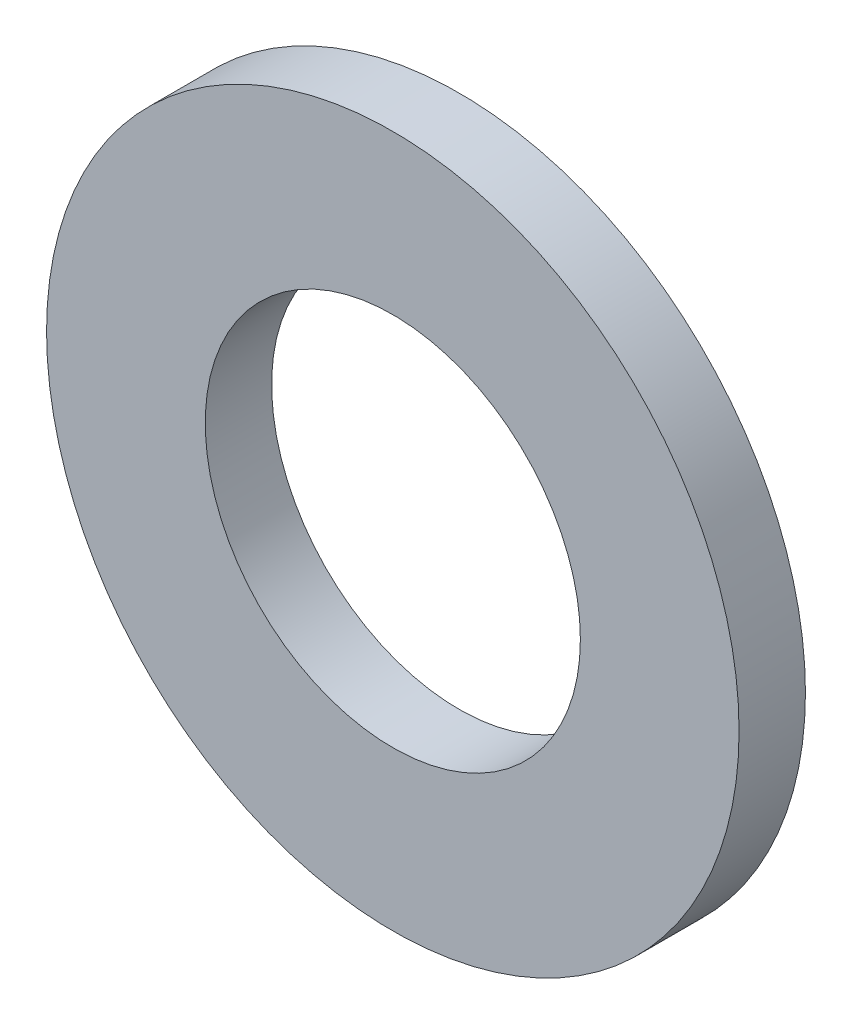
ISO-10303-21;
HEADER;
FILE_DESCRIPTION(('STEP AP214'),'2;1');
FILE_NAME('part.step','',(''),(''),'','','');
FILE_SCHEMA(('AUTOMOTIVE_DESIGN { 1 0 10303 214 1 1 1 1 }'));
ENDSEC;
DATA;
#1=APPLICATION_CONTEXT('core data for automotive mechanical design processes');
#2=APPLICATION_PROTOCOL_DEFINITION('international standard','automotive_design',2000,#1);
#3=PRODUCT_CONTEXT('',#1,'mechanical');
#4=PRODUCT('Part','Part','',(#3));
#5=PRODUCT_RELATED_PRODUCT_CATEGORY('part','',(#4));
#6=PRODUCT_DEFINITION_FORMATION('','',#4);
#7=PRODUCT_DEFINITION_CONTEXT('part definition',#1,'design');
#8=PRODUCT_DEFINITION('design','',#6,#7);
#9=PRODUCT_DEFINITION_SHAPE('','',#8);
#10=(LENGTH_UNIT() NAMED_UNIT(*) SI_UNIT(.MILLI.,.METRE.));
#11=(NAMED_UNIT(*) PLANE_ANGLE_UNIT() SI_UNIT($,.RADIAN.));
#12=(NAMED_UNIT(*) SI_UNIT($,.STERADIAN.) SOLID_ANGLE_UNIT());
#13=UNCERTAINTY_MEASURE_WITH_UNIT(LENGTH_MEASURE(1.E-05),#10,'distance_accuracy_value','');
#14=(GEOMETRIC_REPRESENTATION_CONTEXT(3) GLOBAL_UNCERTAINTY_ASSIGNED_CONTEXT((#13)) GLOBAL_UNIT_ASSIGNED_CONTEXT((#10,
#11,#12)) REPRESENTATION_CONTEXT('',''));
#15=CARTESIAN_POINT('',(0.,0.,0.));
#16=DIRECTION('',(0.,0.,1.));
#17=DIRECTION('',(1.,0.,0.));
#18=AXIS2_PLACEMENT_3D('',#15,#16,#17);
#19=CARTESIAN_POINT('',(0.,0.,-2.3));
#20=DIRECTION('',(0.,0.,1.));
#21=DIRECTION('',(1.,0.,0.));
#22=AXIS2_PLACEMENT_3D('',#19,#20,#21);
#23=CYLINDRICAL_SURFACE('',#22,12.);
#24=CARTESIAN_POINT('',(0.,0.,-2.3));
#25=DIRECTION('',(0.,0.,1.));
#26=DIRECTION('',(1.,0.,0.));
#27=AXIS2_PLACEMENT_3D('',#24,#25,#26);
#28=CIRCLE('',#27,12.);
#29=CARTESIAN_POINT('',(12.,0.,-2.3));
#30=VERTEX_POINT('',#29);
#31=EDGE_CURVE('E10',#30,#30,#28,.T.);
#32=ORIENTED_EDGE('',*,*,#31,.T.);
#33=EDGE_LOOP('',(#32));
#34=FACE_BOUND('',#33,.T.);
#35=CARTESIAN_POINT('',(0.,0.,0.));
#36=DIRECTION('',(0.,0.,1.));
#37=DIRECTION('',(1.,0.,0.));
#38=AXIS2_PLACEMENT_3D('',#35,#36,#37);
#39=CIRCLE('',#38,12.);
#40=CARTESIAN_POINT('',(12.,0.,0.));
#41=VERTEX_POINT('',#40);
#42=EDGE_CURVE('E33',#41,#41,#39,.T.);
#43=ORIENTED_EDGE('',*,*,#42,.F.);
#44=EDGE_LOOP('',(#43));
#45=FACE_BOUND('',#44,.T.);
#46=ADVANCED_FACE('F30',(#34,#45),#23,.T.);
#47=CARTESIAN_POINT('',(0.,0.,-2.3));
#48=DIRECTION('',(0.,0.,1.));
#49=DIRECTION('',(1.,0.,0.));
#50=AXIS2_PLACEMENT_3D('',#47,#48,#49);
#51=PLANE('',#50);
#52=CARTESIAN_POINT('',(0.,0.,-2.3));
#53=DIRECTION('',(0.,0.,1.));
#54=DIRECTION('',(1.,0.,0.));
#55=AXIS2_PLACEMENT_3D('',#52,#53,#54);
#56=CIRCLE('',#55,6.5);
#57=CARTESIAN_POINT('',(6.5,0.,-2.3));
#58=VERTEX_POINT('',#57);
#59=EDGE_CURVE('E40',#58,#58,#56,.T.);
#60=ORIENTED_EDGE('',*,*,#59,.T.);
#61=EDGE_LOOP('',(#60));
#62=FACE_BOUND('',#61,.T.);
#63=ORIENTED_EDGE('',*,*,#31,.F.);
#64=EDGE_LOOP('',(#63));
#65=FACE_BOUND('',#64,.T.);
#66=ADVANCED_FACE('F48',(#62,#65),#51,.F.);
#67=CARTESIAN_POINT('',(0.,0.,0.));
#68=DIRECTION('',(0.,0.,1.));
#69=DIRECTION('',(1.,0.,0.));
#70=AXIS2_PLACEMENT_3D('',#67,#68,#69);
#71=PLANE('',#70);
#72=CARTESIAN_POINT('',(0.,0.,0.));
#73=DIRECTION('',(0.,0.,1.));
#74=DIRECTION('',(1.,0.,0.));
#75=AXIS2_PLACEMENT_3D('',#72,#73,#74);
#76=CIRCLE('',#75,6.5);
#77=CARTESIAN_POINT('',(6.5,0.,0.));
#78=VERTEX_POINT('',#77);
#79=EDGE_CURVE('E42',#78,#78,#76,.T.);
#80=ORIENTED_EDGE('',*,*,#79,.F.);
#81=EDGE_LOOP('',(#80));
#82=FACE_BOUND('',#81,.T.);
#83=ORIENTED_EDGE('',*,*,#42,.T.);
#84=EDGE_LOOP('',(#83));
#85=FACE_BOUND('',#84,.T.);
#86=ADVANCED_FACE('F54',(#82,#85),#71,.T.);
#87=CARTESIAN_POINT('',(0.,0.,-2.3));
#88=DIRECTION('',(0.,0.,1.));
#89=DIRECTION('',(1.,0.,0.));
#90=AXIS2_PLACEMENT_3D('',#87,#88,#89);
#91=CYLINDRICAL_SURFACE('',#90,6.5);
#92=ORIENTED_EDGE('',*,*,#59,.F.);
#93=EDGE_LOOP('',(#92));
#94=FACE_BOUND('',#93,.T.);
#95=ORIENTED_EDGE('',*,*,#79,.T.);
#96=EDGE_LOOP('',(#95));
#97=FACE_BOUND('',#96,.T.);
#98=ADVANCED_FACE('F51',(#94,#97),#91,.F.);
#99=CLOSED_SHELL('',(#46,#66,#86,#98));
#100=MANIFOLD_SOLID_BREP('B2',#99);
#101=ADVANCED_BREP_SHAPE_REPRESENTATION('',(#18,#100),#14);
#102=SHAPE_DEFINITION_REPRESENTATION(#9,#101);
ENDSEC;
END-ISO-10303-21;
